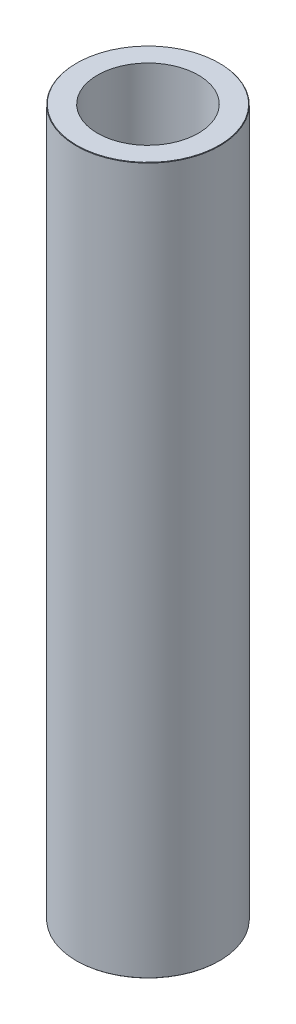
ISO-10303-21;
HEADER;
FILE_DESCRIPTION(('STEP AP214'),'2;1');
FILE_NAME('part.step','',(''),(''),'','','');
FILE_SCHEMA(('AUTOMOTIVE_DESIGN { 1 0 10303 214 1 1 1 1 }'));
ENDSEC;
DATA;
#1=APPLICATION_CONTEXT('core data for automotive mechanical design processes');
#2=APPLICATION_PROTOCOL_DEFINITION('international standard','automotive_design',2000,#1);
#3=PRODUCT_CONTEXT('',#1,'mechanical');
#4=PRODUCT('Part','Part','',(#3));
#5=PRODUCT_RELATED_PRODUCT_CATEGORY('part','',(#4));
#6=PRODUCT_DEFINITION_FORMATION('','',#4);
#7=PRODUCT_DEFINITION_CONTEXT('part definition',#1,'design');
#8=PRODUCT_DEFINITION('design','',#6,#7);
#9=PRODUCT_DEFINITION_SHAPE('','',#8);
#10=(LENGTH_UNIT() NAMED_UNIT(*) SI_UNIT(.MILLI.,.METRE.));
#11=(NAMED_UNIT(*) PLANE_ANGLE_UNIT() SI_UNIT($,.RADIAN.));
#12=(NAMED_UNIT(*) SI_UNIT($,.STERADIAN.) SOLID_ANGLE_UNIT());
#13=UNCERTAINTY_MEASURE_WITH_UNIT(LENGTH_MEASURE(1.E-05),#10,'distance_accuracy_value','');
#14=(GEOMETRIC_REPRESENTATION_CONTEXT(3) GLOBAL_UNCERTAINTY_ASSIGNED_CONTEXT((#13)) GLOBAL_UNIT_ASSIGNED_CONTEXT((#10,
#11,#12)) REPRESENTATION_CONTEXT('',''));
#15=CARTESIAN_POINT('',(0.,0.,0.));
#16=DIRECTION('',(0.,0.,1.));
#17=DIRECTION('',(1.,0.,0.));
#18=AXIS2_PLACEMENT_3D('',#15,#16,#17);
#19=CARTESIAN_POINT('',(0.,493.005254962089,0.));
#20=DIRECTION('',(0.,-1.,0.));
#21=DIRECTION('',(0.,0.,-1.));
#22=AXIS2_PLACEMENT_3D('',#19,#20,#21);
#23=CYLINDRICAL_SURFACE('',#22,50.);
#24=CARTESIAN_POINT('',(0.,492.723061929771,0.));
#25=DIRECTION('',(0.,1.,0.));
#26=DIRECTION('',(0.,0.,1.));
#27=AXIS2_PLACEMENT_3D('',#24,#25,#26);
#28=CIRCLE('',#27,50.);
#29=CARTESIAN_POINT('',(0.,492.723061929771,50.));
#30=VERTEX_POINT('',#29);
#31=EDGE_CURVE('E50',#30,#30,#28,.F.);
#32=ORIENTED_EDGE('',*,*,#31,.T.);
#33=EDGE_LOOP('',(#32));
#34=FACE_BOUND('',#33,.T.);
#35=CARTESIAN_POINT('',(0.,0.282193032318023,0.));
#36=DIRECTION('',(0.,1.,0.));
#37=DIRECTION('',(0.,0.,1.));
#38=AXIS2_PLACEMENT_3D('',#35,#36,#37);
#39=CIRCLE('',#38,50.);
#40=CARTESIAN_POINT('',(0.,0.282193032318023,50.));
#41=VERTEX_POINT('',#40);
#42=EDGE_CURVE('E51',#41,#41,#39,.T.);
#43=ORIENTED_EDGE('',*,*,#42,.T.);
#44=EDGE_LOOP('',(#43));
#45=FACE_BOUND('',#44,.T.);
#46=ADVANCED_FACE('F39',(#34,#45),#23,.T.);
#47=CARTESIAN_POINT('',(0.,493.005254962089,0.));
#48=DIRECTION('',(0.,1.,0.));
#49=DIRECTION('',(0.,0.,1.));
#50=AXIS2_PLACEMENT_3D('',#47,#48,#49);
#51=PLANE('',#50);
#52=CARTESIAN_POINT('',(0.,493.005254962089,0.));
#53=DIRECTION('',(0.,1.,0.));
#54=DIRECTION('',(0.,0.,1.));
#55=AXIS2_PLACEMENT_3D('',#52,#53,#54);
#56=CIRCLE('',#55,49.7178069676819);
#57=CARTESIAN_POINT('',(0.,493.005254962089,49.7178069676819));
#58=VERTEX_POINT('',#57);
#59=EDGE_CURVE('E54',#58,#58,#56,.T.);
#60=ORIENTED_EDGE('',*,*,#59,.T.);
#61=EDGE_LOOP('',(#60));
#62=FACE_BOUND('',#61,.T.);
#63=CARTESIAN_POINT('',(0.,493.005254962089,0.));
#64=DIRECTION('',(0.,1.,0.));
#65=DIRECTION('',(0.,0.,1.));
#66=AXIS2_PLACEMENT_3D('',#63,#64,#65);
#67=CIRCLE('',#66,35.1975034355809);
#68=CARTESIAN_POINT('',(0.,493.005254962089,35.1975034355809));
#69=VERTEX_POINT('',#68);
#70=EDGE_CURVE('E58',#69,#69,#67,.T.);
#71=ORIENTED_EDGE('',*,*,#70,.F.);
#72=EDGE_LOOP('',(#71));
#73=FACE_BOUND('',#72,.T.);
#74=ADVANCED_FACE('F69',(#62,#73),#51,.T.);
#75=CARTESIAN_POINT('',(0.,0.,0.));
#76=DIRECTION('',(0.,1.,0.));
#77=DIRECTION('',(0.,0.,1.));
#78=AXIS2_PLACEMENT_3D('',#75,#76,#77);
#79=PLANE('',#78);
#80=CARTESIAN_POINT('',(0.,0.,0.));
#81=DIRECTION('',(0.,1.,0.));
#82=DIRECTION('',(0.,0.,1.));
#83=AXIS2_PLACEMENT_3D('',#80,#81,#82);
#84=CIRCLE('',#83,49.717806967682);
#85=CARTESIAN_POINT('',(0.,0.,49.717806967682));
#86=VERTEX_POINT('',#85);
#87=EDGE_CURVE('E10',#86,#86,#84,.F.);
#88=ORIENTED_EDGE('',*,*,#87,.T.);
#89=EDGE_LOOP('',(#88));
#90=FACE_BOUND('',#89,.T.);
#91=CARTESIAN_POINT('',(0.,0.,0.));
#92=DIRECTION('',(0.,1.,0.));
#93=DIRECTION('',(0.,0.,1.));
#94=AXIS2_PLACEMENT_3D('',#91,#92,#93);
#95=CIRCLE('',#94,35.1975034355809);
#96=CARTESIAN_POINT('',(0.,0.,35.1975034355809));
#97=VERTEX_POINT('',#96);
#98=EDGE_CURVE('E63',#97,#97,#95,.T.);
#99=ORIENTED_EDGE('',*,*,#98,.T.);
#100=EDGE_LOOP('',(#99));
#101=FACE_BOUND('',#100,.T.);
#102=ADVANCED_FACE('F75',(#90,#101),#79,.F.);
#103=CARTESIAN_POINT('',(0.,493.005254962089,0.));
#104=DIRECTION('',(0.,-1.,0.));
#105=DIRECTION('',(0.,0.,-1.));
#106=AXIS2_PLACEMENT_3D('',#103,#104,#105);
#107=CYLINDRICAL_SURFACE('',#106,35.1975034355809);
#108=ORIENTED_EDGE('',*,*,#70,.T.);
#109=EDGE_LOOP('',(#108));
#110=FACE_BOUND('',#109,.T.);
#111=ORIENTED_EDGE('',*,*,#98,.F.);
#112=EDGE_LOOP('',(#111));
#113=FACE_BOUND('',#112,.T.);
#114=ADVANCED_FACE('F70',(#110,#113),#107,.F.);
#115=CARTESIAN_POINT('',(0.,493.005254962089,0.));
#116=DIRECTION('',(0.,-1.,0.));
#117=DIRECTION('',(0.,0.,-1.));
#118=AXIS2_PLACEMENT_3D('',#115,#116,#117);
#119=CONICAL_SURFACE('',#118,49.7178069676819,0.785398163397375);
#120=ORIENTED_EDGE('',*,*,#31,.F.);
#121=EDGE_LOOP('',(#120));
#122=FACE_BOUND('',#121,.T.);
#123=ORIENTED_EDGE('',*,*,#59,.F.);
#124=EDGE_LOOP('',(#123));
#125=FACE_BOUND('',#124,.T.);
#126=ADVANCED_FACE('F81',(#122,#125),#119,.T.);
#127=CARTESIAN_POINT('',(0.,0.282193032318023,0.));
#128=DIRECTION('',(0.,1.,0.));
#129=DIRECTION('',(0.,0.,1.));
#130=AXIS2_PLACEMENT_3D('',#127,#128,#129);
#131=CONICAL_SURFACE('',#130,50.,0.785398163397461);
#132=ORIENTED_EDGE('',*,*,#87,.F.);
#133=EDGE_LOOP('',(#132));
#134=FACE_BOUND('',#133,.T.);
#135=ORIENTED_EDGE('',*,*,#42,.F.);
#136=EDGE_LOOP('',(#135));
#137=FACE_BOUND('',#136,.T.);
#138=ADVANCED_FACE('F45',(#134,#137),#131,.T.);
#139=CLOSED_SHELL('',(#46,#74,#102,#114,#126,#138));
#140=MANIFOLD_SOLID_BREP('B2',#139);
#141=ADVANCED_BREP_SHAPE_REPRESENTATION('',(#18,#140),#14);
#142=SHAPE_DEFINITION_REPRESENTATION(#9,#141);
ENDSEC;
END-ISO-10303-21;
